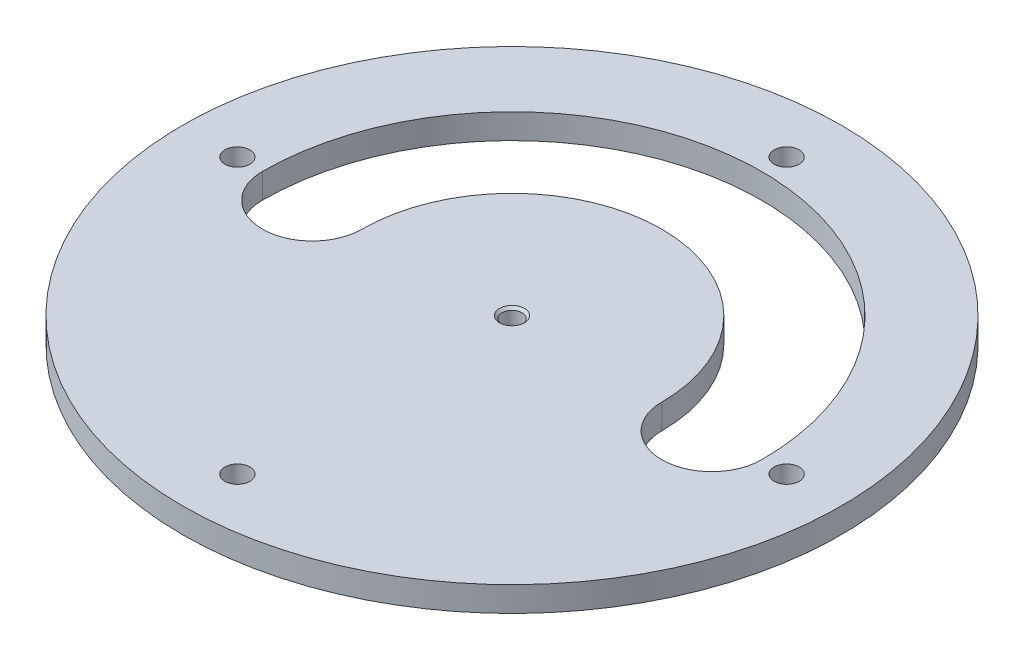
ISO-10303-21;
HEADER;
FILE_DESCRIPTION(('STEP AP214'),'2;1');
FILE_NAME('part.step','',(''),(''),'','','');
FILE_SCHEMA(('AUTOMOTIVE_DESIGN { 1 0 10303 214 1 1 1 1 }'));
ENDSEC;
DATA;
#1=APPLICATION_CONTEXT('core data for automotive mechanical design processes');
#2=APPLICATION_PROTOCOL_DEFINITION('international standard','automotive_design',2000,#1);
#3=PRODUCT_CONTEXT('',#1,'mechanical');
#4=PRODUCT('Part','Part','',(#3));
#5=PRODUCT_RELATED_PRODUCT_CATEGORY('part','',(#4));
#6=PRODUCT_DEFINITION_FORMATION('','',#4);
#7=PRODUCT_DEFINITION_CONTEXT('part definition',#1,'design');
#8=PRODUCT_DEFINITION('design','',#6,#7);
#9=PRODUCT_DEFINITION_SHAPE('','',#8);
#10=(LENGTH_UNIT() NAMED_UNIT(*) SI_UNIT(.MILLI.,.METRE.));
#11=(NAMED_UNIT(*) PLANE_ANGLE_UNIT() SI_UNIT($,.RADIAN.));
#12=(NAMED_UNIT(*) SI_UNIT($,.STERADIAN.) SOLID_ANGLE_UNIT());
#13=UNCERTAINTY_MEASURE_WITH_UNIT(LENGTH_MEASURE(1.E-05),#10,'distance_accuracy_value','');
#14=(GEOMETRIC_REPRESENTATION_CONTEXT(3) GLOBAL_UNCERTAINTY_ASSIGNED_CONTEXT((#13)) GLOBAL_UNIT_ASSIGNED_CONTEXT((#10,
#11,#12)) REPRESENTATION_CONTEXT('',''));
#15=CARTESIAN_POINT('',(0.,0.,0.));
#16=DIRECTION('',(0.,0.,1.));
#17=DIRECTION('',(1.,0.,0.));
#18=AXIS2_PLACEMENT_3D('',#15,#16,#17);
#19=CARTESIAN_POINT('',(0.,2.5,0.));
#20=DIRECTION('',(0.,1.,0.));
#21=DIRECTION('',(0.,0.,1.));
#22=AXIS2_PLACEMENT_3D('',#19,#20,#21);
#23=PLANE('',#22);
#24=CARTESIAN_POINT('',(0.,2.5,0.));
#25=DIRECTION('',(0.,1.,0.));
#26=DIRECTION('',(0.,0.,1.));
#27=AXIS2_PLACEMENT_3D('',#24,#25,#26);
#28=CIRCLE('',#27,1.25000000000003);
#29=CARTESIAN_POINT('',(0.,2.5,1.25000000000003));
#30=VERTEX_POINT('',#29);
#31=EDGE_CURVE('E12',#30,#30,#28,.F.);
#32=ORIENTED_EDGE('',*,*,#31,.T.);
#33=EDGE_LOOP('',(#32));
#34=FACE_BOUND('',#33,.T.);
#35=CARTESIAN_POINT('',(0.,2.5,27.5));
#36=DIRECTION('',(0.,1.,0.));
#37=DIRECTION('',(0.,0.,1.));
#38=AXIS2_PLACEMENT_3D('',#35,#36,#37);
#39=CIRCLE('',#38,1.25000000000019);
#40=CARTESIAN_POINT('',(0.,2.5,28.7500000000002));
#41=VERTEX_POINT('',#40);
#42=EDGE_CURVE('E143',#41,#41,#39,.T.);
#43=ORIENTED_EDGE('',*,*,#42,.F.);
#44=EDGE_LOOP('',(#43));
#45=FACE_BOUND('',#44,.T.);
#46=CARTESIAN_POINT('',(0.,2.5,-27.5));
#47=DIRECTION('',(0.,1.,0.));
#48=DIRECTION('',(0.,0.,1.));
#49=AXIS2_PLACEMENT_3D('',#46,#47,#48);
#50=CIRCLE('',#49,1.25);
#51=CARTESIAN_POINT('',(0.,2.5,-26.25));
#52=VERTEX_POINT('',#51);
#53=EDGE_CURVE('E155',#52,#52,#50,.T.);
#54=ORIENTED_EDGE('',*,*,#53,.F.);
#55=EDGE_LOOP('',(#54));
#56=FACE_BOUND('',#55,.T.);
#57=CARTESIAN_POINT('',(0.,2.5,0.));
#58=DIRECTION('',(0.,1.,0.));
#59=DIRECTION('',(0.,0.,1.));
#60=AXIS2_PLACEMENT_3D('',#57,#58,#59);
#61=CIRCLE('',#60,33.);
#62=CARTESIAN_POINT('',(0.,2.5,33.));
#63=VERTEX_POINT('',#62);
#64=EDGE_CURVE('E167',#63,#63,#61,.T.);
#65=ORIENTED_EDGE('',*,*,#64,.T.);
#66=EDGE_LOOP('',(#65));
#67=FACE_BOUND('',#66,.T.);
#68=CARTESIAN_POINT('',(-27.5,2.5,0.));
#69=DIRECTION('',(0.,1.,0.));
#70=DIRECTION('',(0.,0.,1.));
#71=AXIS2_PLACEMENT_3D('',#68,#69,#70);
#72=CIRCLE('',#71,1.25000000000028);
#73=CARTESIAN_POINT('',(-27.5,2.5,1.25000000000029));
#74=VERTEX_POINT('',#73);
#75=EDGE_CURVE('E161',#74,#74,#72,.T.);
#76=ORIENTED_EDGE('',*,*,#75,.F.);
#77=EDGE_LOOP('',(#76));
#78=FACE_BOUND('',#77,.T.);
#79=CARTESIAN_POINT('',(27.5,2.5,0.));
#80=DIRECTION('',(0.,1.,0.));
#81=DIRECTION('',(0.,0.,1.));
#82=AXIS2_PLACEMENT_3D('',#79,#80,#81);
#83=CIRCLE('',#82,1.25000000000009);
#84=CARTESIAN_POINT('',(27.5,2.5,1.25000000000009));
#85=VERTEX_POINT('',#84);
#86=EDGE_CURVE('E149',#85,#85,#83,.T.);
#87=ORIENTED_EDGE('',*,*,#86,.F.);
#88=EDGE_LOOP('',(#87));
#89=FACE_BOUND('',#88,.T.);
#90=CARTESIAN_POINT('',(0.,2.5,0.));
#91=DIRECTION('',(0.,1.,0.));
#92=DIRECTION('',(0.,0.,1.));
#93=AXIS2_PLACEMENT_3D('',#90,#91,#92);
#94=CIRCLE('',#93,25.);
#95=CARTESIAN_POINT('',(25.,2.5,0.));
#96=VERTEX_POINT('',#95);
#97=CARTESIAN_POINT('',(-25.,2.5,0.));
#98=VERTEX_POINT('',#97);
#99=EDGE_CURVE('E119',#96,#98,#94,.T.);
#100=ORIENTED_EDGE('',*,*,#99,.F.);
#101=CARTESIAN_POINT('',(20.,2.5,0.));
#102=DIRECTION('',(0.,1.,0.));
#103=DIRECTION('',(0.,0.,1.));
#104=AXIS2_PLACEMENT_3D('',#101,#102,#103);
#105=CIRCLE('',#104,5.);
#106=CARTESIAN_POINT('',(15.,2.5,0.));
#107=VERTEX_POINT('',#106);
#108=EDGE_CURVE('E111',#107,#96,#105,.T.);
#109=ORIENTED_EDGE('',*,*,#108,.F.);
#110=CARTESIAN_POINT('',(0.,2.5,0.));
#111=DIRECTION('',(0.,-1.,0.));
#112=DIRECTION('',(0.,0.,1.));
#113=AXIS2_PLACEMENT_3D('',#110,#111,#112);
#114=CIRCLE('',#113,15.);
#115=CARTESIAN_POINT('',(-15.,2.5,0.));
#116=VERTEX_POINT('',#115);
#117=EDGE_CURVE('E133',#116,#107,#114,.T.);
#118=ORIENTED_EDGE('',*,*,#117,.F.);
#119=CARTESIAN_POINT('',(-20.,2.5,0.));
#120=DIRECTION('',(0.,1.,0.));
#121=DIRECTION('',(0.,0.,-1.));
#122=AXIS2_PLACEMENT_3D('',#119,#120,#121);
#123=CIRCLE('',#122,5.);
#124=EDGE_CURVE('E131',#98,#116,#123,.T.);
#125=ORIENTED_EDGE('',*,*,#124,.F.);
#126=EDGE_LOOP('',(#100,#109,#118,#125));
#127=FACE_BOUND('',#126,.T.);
#128=ADVANCED_FACE('F70',(#34,#45,#56,#67,#78,#89,#127),#23,.T.);
#129=CARTESIAN_POINT('',(0.,0.,0.));
#130=DIRECTION('',(0.,1.,0.));
#131=DIRECTION('',(0.,0.,1.));
#132=AXIS2_PLACEMENT_3D('',#129,#130,#131);
#133=PLANE('',#132);
#134=CARTESIAN_POINT('',(0.,0.,0.));
#135=DIRECTION('',(0.,1.,0.));
#136=DIRECTION('',(0.,0.,1.));
#137=AXIS2_PLACEMENT_3D('',#134,#135,#136);
#138=CIRCLE('',#137,1.);
#139=CARTESIAN_POINT('',(0.,0.,1.));
#140=VERTEX_POINT('',#139);
#141=EDGE_CURVE('E127',#140,#140,#138,.T.);
#142=ORIENTED_EDGE('',*,*,#141,.T.);
#143=EDGE_LOOP('',(#142));
#144=FACE_BOUND('',#143,.T.);
#145=CARTESIAN_POINT('',(0.,0.,27.5));
#146=DIRECTION('',(0.,1.,0.));
#147=DIRECTION('',(0.,0.,1.));
#148=AXIS2_PLACEMENT_3D('',#145,#146,#147);
#149=CIRCLE('',#148,1.25000000000019);
#150=CARTESIAN_POINT('',(0.,0.,28.7500000000002));
#151=VERTEX_POINT('',#150);
#152=EDGE_CURVE('E142',#151,#151,#149,.T.);
#153=ORIENTED_EDGE('',*,*,#152,.T.);
#154=EDGE_LOOP('',(#153));
#155=FACE_BOUND('',#154,.T.);
#156=CARTESIAN_POINT('',(27.5,0.,0.));
#157=DIRECTION('',(0.,1.,0.));
#158=DIRECTION('',(0.,0.,1.));
#159=AXIS2_PLACEMENT_3D('',#156,#157,#158);
#160=CIRCLE('',#159,1.25000000000009);
#161=CARTESIAN_POINT('',(27.5,0.,1.25000000000009));
#162=VERTEX_POINT('',#161);
#163=EDGE_CURVE('E146',#162,#162,#160,.T.);
#164=ORIENTED_EDGE('',*,*,#163,.T.);
#165=EDGE_LOOP('',(#164));
#166=FACE_BOUND('',#165,.T.);
#167=CARTESIAN_POINT('',(0.,0.,-27.5));
#168=DIRECTION('',(0.,1.,0.));
#169=DIRECTION('',(0.,0.,1.));
#170=AXIS2_PLACEMENT_3D('',#167,#168,#169);
#171=CIRCLE('',#170,1.25);
#172=CARTESIAN_POINT('',(0.,0.,-26.25));
#173=VERTEX_POINT('',#172);
#174=EDGE_CURVE('E152',#173,#173,#171,.T.);
#175=ORIENTED_EDGE('',*,*,#174,.T.);
#176=EDGE_LOOP('',(#175));
#177=FACE_BOUND('',#176,.T.);
#178=CARTESIAN_POINT('',(-27.5,0.,0.));
#179=DIRECTION('',(0.,1.,0.));
#180=DIRECTION('',(0.,0.,1.));
#181=AXIS2_PLACEMENT_3D('',#178,#179,#180);
#182=CIRCLE('',#181,1.25000000000028);
#183=CARTESIAN_POINT('',(-27.5,0.,1.25000000000029));
#184=VERTEX_POINT('',#183);
#185=EDGE_CURVE('E158',#184,#184,#182,.T.);
#186=ORIENTED_EDGE('',*,*,#185,.T.);
#187=EDGE_LOOP('',(#186));
#188=FACE_BOUND('',#187,.T.);
#189=CARTESIAN_POINT('',(0.,0.,0.));
#190=DIRECTION('',(0.,1.,0.));
#191=DIRECTION('',(0.,0.,1.));
#192=AXIS2_PLACEMENT_3D('',#189,#190,#191);
#193=CIRCLE('',#192,33.);
#194=CARTESIAN_POINT('',(0.,0.,33.));
#195=VERTEX_POINT('',#194);
#196=EDGE_CURVE('E164',#195,#195,#193,.T.);
#197=ORIENTED_EDGE('',*,*,#196,.F.);
#198=EDGE_LOOP('',(#197));
#199=FACE_BOUND('',#198,.T.);
#200=CARTESIAN_POINT('',(20.,0.,0.));
#201=DIRECTION('',(0.,1.,0.));
#202=DIRECTION('',(0.,0.,1.));
#203=AXIS2_PLACEMENT_3D('',#200,#201,#202);
#204=CIRCLE('',#203,5.);
#205=CARTESIAN_POINT('',(25.,0.,0.));
#206=VERTEX_POINT('',#205);
#207=CARTESIAN_POINT('',(15.,0.,0.));
#208=VERTEX_POINT('',#207);
#209=EDGE_CURVE('E177',#206,#208,#204,.F.);
#210=ORIENTED_EDGE('',*,*,#209,.F.);
#211=CARTESIAN_POINT('',(0.,0.,0.));
#212=DIRECTION('',(0.,1.,0.));
#213=DIRECTION('',(0.,0.,1.));
#214=AXIS2_PLACEMENT_3D('',#211,#212,#213);
#215=CIRCLE('',#214,25.);
#216=CARTESIAN_POINT('',(-25.,0.,0.));
#217=VERTEX_POINT('',#216);
#218=EDGE_CURVE('E126',#217,#206,#215,.F.);
#219=ORIENTED_EDGE('',*,*,#218,.F.);
#220=CARTESIAN_POINT('',(-20.,0.,0.));
#221=DIRECTION('',(0.,1.,0.));
#222=DIRECTION('',(0.,0.,1.));
#223=AXIS2_PLACEMENT_3D('',#220,#221,#222);
#224=CIRCLE('',#223,5.);
#225=CARTESIAN_POINT('',(-15.,0.,0.));
#226=VERTEX_POINT('',#225);
#227=EDGE_CURVE('E174',#226,#217,#224,.F.);
#228=ORIENTED_EDGE('',*,*,#227,.F.);
#229=CARTESIAN_POINT('',(0.,0.,0.));
#230=DIRECTION('',(0.,1.,0.));
#231=DIRECTION('',(0.,0.,1.));
#232=AXIS2_PLACEMENT_3D('',#229,#230,#231);
#233=CIRCLE('',#232,15.);
#234=EDGE_CURVE('E170',#208,#226,#233,.T.);
#235=ORIENTED_EDGE('',*,*,#234,.F.);
#236=EDGE_LOOP('',(#210,#219,#228,#235));
#237=FACE_BOUND('',#236,.T.);
#238=ADVANCED_FACE('F194',(#144,#155,#166,#177,#188,#199,#237),#133,.F.);
#239=CARTESIAN_POINT('',(0.,2.5,0.));
#240=DIRECTION('',(0.,-1.,0.));
#241=DIRECTION('',(0.,0.,-1.));
#242=AXIS2_PLACEMENT_3D('',#239,#240,#241);
#243=CYLINDRICAL_SURFACE('',#242,33.);
#244=ORIENTED_EDGE('',*,*,#64,.F.);
#245=EDGE_LOOP('',(#244));
#246=FACE_BOUND('',#245,.T.);
#247=ORIENTED_EDGE('',*,*,#196,.T.);
#248=EDGE_LOOP('',(#247));
#249=FACE_BOUND('',#248,.T.);
#250=ADVANCED_FACE('F200',(#246,#249),#243,.T.);
#251=CARTESIAN_POINT('',(-27.5,2.5,0.));
#252=DIRECTION('',(0.,-1.,0.));
#253=DIRECTION('',(0.,0.,-1.));
#254=AXIS2_PLACEMENT_3D('',#251,#252,#253);
#255=CYLINDRICAL_SURFACE('',#254,1.25000000000028);
#256=ORIENTED_EDGE('',*,*,#75,.T.);
#257=EDGE_LOOP('',(#256));
#258=FACE_BOUND('',#257,.T.);
#259=ORIENTED_EDGE('',*,*,#185,.F.);
#260=EDGE_LOOP('',(#259));
#261=FACE_BOUND('',#260,.T.);
#262=ADVANCED_FACE('F205',(#258,#261),#255,.F.);
#263=CARTESIAN_POINT('',(0.,2.5,-27.5));
#264=DIRECTION('',(0.,-1.,0.));
#265=DIRECTION('',(0.,0.,-1.));
#266=AXIS2_PLACEMENT_3D('',#263,#264,#265);
#267=CYLINDRICAL_SURFACE('',#266,1.25);
#268=ORIENTED_EDGE('',*,*,#53,.T.);
#269=EDGE_LOOP('',(#268));
#270=FACE_BOUND('',#269,.T.);
#271=ORIENTED_EDGE('',*,*,#174,.F.);
#272=EDGE_LOOP('',(#271));
#273=FACE_BOUND('',#272,.T.);
#274=ADVANCED_FACE('F212',(#270,#273),#267,.F.);
#275=CARTESIAN_POINT('',(27.5,2.5,0.));
#276=DIRECTION('',(0.,-1.,0.));
#277=DIRECTION('',(0.,0.,-1.));
#278=AXIS2_PLACEMENT_3D('',#275,#276,#277);
#279=CYLINDRICAL_SURFACE('',#278,1.25000000000009);
#280=ORIENTED_EDGE('',*,*,#86,.T.);
#281=EDGE_LOOP('',(#280));
#282=FACE_BOUND('',#281,.T.);
#283=ORIENTED_EDGE('',*,*,#163,.F.);
#284=EDGE_LOOP('',(#283));
#285=FACE_BOUND('',#284,.T.);
#286=ADVANCED_FACE('F236',(#282,#285),#279,.F.);
#287=CARTESIAN_POINT('',(0.,2.5,27.5));
#288=DIRECTION('',(0.,-1.,0.));
#289=DIRECTION('',(0.,0.,-1.));
#290=AXIS2_PLACEMENT_3D('',#287,#288,#289);
#291=CYLINDRICAL_SURFACE('',#290,1.25000000000019);
#292=ORIENTED_EDGE('',*,*,#42,.T.);
#293=EDGE_LOOP('',(#292));
#294=FACE_BOUND('',#293,.T.);
#295=ORIENTED_EDGE('',*,*,#152,.F.);
#296=EDGE_LOOP('',(#295));
#297=FACE_BOUND('',#296,.T.);
#298=ADVANCED_FACE('F233',(#294,#297),#291,.F.);
#299=CARTESIAN_POINT('',(0.,2.5,0.));
#300=DIRECTION('',(0.,-1.,0.));
#301=DIRECTION('',(0.,0.,-1.));
#302=AXIS2_PLACEMENT_3D('',#299,#300,#301);
#303=CYLINDRICAL_SURFACE('',#302,1.);
#304=CARTESIAN_POINT('',(0.,2.24999999999998,0.));
#305=DIRECTION('',(0.,1.,0.));
#306=DIRECTION('',(0.,0.,1.));
#307=AXIS2_PLACEMENT_3D('',#304,#305,#306);
#308=CIRCLE('',#307,1.);
#309=CARTESIAN_POINT('',(0.,2.24999999999998,1.));
#310=VERTEX_POINT('',#309);
#311=EDGE_CURVE('E79',#310,#310,#308,.T.);
#312=ORIENTED_EDGE('',*,*,#311,.T.);
#313=EDGE_LOOP('',(#312));
#314=FACE_BOUND('',#313,.T.);
#315=ORIENTED_EDGE('',*,*,#141,.F.);
#316=EDGE_LOOP('',(#315));
#317=FACE_BOUND('',#316,.T.);
#318=ADVANCED_FACE('F181',(#314,#317),#303,.F.);
#319=CARTESIAN_POINT('',(20.,2.5,0.));
#320=DIRECTION('',(0.,-1.,0.));
#321=DIRECTION('',(0.,0.,-1.));
#322=AXIS2_PLACEMENT_3D('',#319,#320,#321);
#323=CYLINDRICAL_SURFACE('',#322,5.);
#324=ORIENTED_EDGE('',*,*,#209,.T.);
#325=DIRECTION('',(0.,-1.,0.));
#326=VECTOR('',#325,1.);
#327=CARTESIAN_POINT('',(15.,2.5,0.));
#328=LINE('',#327,#326);
#329=EDGE_CURVE('E91',#107,#208,#328,.T.);
#330=ORIENTED_EDGE('',*,*,#329,.F.);
#331=ORIENTED_EDGE('',*,*,#108,.T.);
#332=DIRECTION('',(0.,-1.,0.));
#333=VECTOR('',#332,1.);
#334=CARTESIAN_POINT('',(25.,2.5,0.));
#335=LINE('',#334,#333);
#336=EDGE_CURVE('E114',#96,#206,#335,.T.);
#337=ORIENTED_EDGE('',*,*,#336,.T.);
#338=EDGE_LOOP('',(#324,#330,#331,#337));
#339=FACE_BOUND('',#338,.T.);
#340=ADVANCED_FACE('F113',(#339),#323,.F.);
#341=CARTESIAN_POINT('',(0.,2.5,0.));
#342=DIRECTION('',(0.,-1.,0.));
#343=DIRECTION('',(0.,0.,-1.));
#344=AXIS2_PLACEMENT_3D('',#341,#342,#343);
#345=CYLINDRICAL_SURFACE('',#344,25.);
#346=ORIENTED_EDGE('',*,*,#218,.T.);
#347=ORIENTED_EDGE('',*,*,#336,.F.);
#348=ORIENTED_EDGE('',*,*,#99,.T.);
#349=DIRECTION('',(0.,-1.,0.));
#350=VECTOR('',#349,1.);
#351=CARTESIAN_POINT('',(-25.,2.5,0.));
#352=LINE('',#351,#350);
#353=EDGE_CURVE('E128',#98,#217,#352,.T.);
#354=ORIENTED_EDGE('',*,*,#353,.T.);
#355=EDGE_LOOP('',(#346,#347,#348,#354));
#356=FACE_BOUND('',#355,.T.);
#357=ADVANCED_FACE('F122',(#356),#345,.F.);
#358=CARTESIAN_POINT('',(-20.,2.5,0.));
#359=DIRECTION('',(0.,-1.,0.));
#360=DIRECTION('',(0.,0.,-1.));
#361=AXIS2_PLACEMENT_3D('',#358,#359,#360);
#362=CYLINDRICAL_SURFACE('',#361,5.);
#363=ORIENTED_EDGE('',*,*,#227,.T.);
#364=ORIENTED_EDGE('',*,*,#353,.F.);
#365=ORIENTED_EDGE('',*,*,#124,.T.);
#366=DIRECTION('',(0.,-1.,0.));
#367=VECTOR('',#366,1.);
#368=CARTESIAN_POINT('',(-15.,2.5,0.));
#369=LINE('',#368,#367);
#370=EDGE_CURVE('E86',#116,#226,#369,.T.);
#371=ORIENTED_EDGE('',*,*,#370,.T.);
#372=EDGE_LOOP('',(#363,#364,#365,#371));
#373=FACE_BOUND('',#372,.T.);
#374=ADVANCED_FACE('F190',(#373),#362,.F.);
#375=CARTESIAN_POINT('',(0.,2.5,0.));
#376=DIRECTION('',(0.,-1.,0.));
#377=DIRECTION('',(0.,0.,-1.));
#378=AXIS2_PLACEMENT_3D('',#375,#376,#377);
#379=CYLINDRICAL_SURFACE('',#378,15.);
#380=ORIENTED_EDGE('',*,*,#234,.T.);
#381=ORIENTED_EDGE('',*,*,#370,.F.);
#382=ORIENTED_EDGE('',*,*,#117,.T.);
#383=ORIENTED_EDGE('',*,*,#329,.T.);
#384=EDGE_LOOP('',(#380,#381,#382,#383));
#385=FACE_BOUND('',#384,.T.);
#386=ADVANCED_FACE('F185',(#385),#379,.T.);
#387=CARTESIAN_POINT('',(0.,2.24999999999998,0.));
#388=DIRECTION('',(0.,1.,0.));
#389=DIRECTION('',(0.,0.,1.));
#390=AXIS2_PLACEMENT_3D('',#387,#388,#389);
#391=CONICAL_SURFACE('',#390,1.,0.785398163397469);
#392=ORIENTED_EDGE('',*,*,#31,.F.);
#393=EDGE_LOOP('',(#392));
#394=FACE_BOUND('',#393,.T.);
#395=ORIENTED_EDGE('',*,*,#311,.F.);
#396=EDGE_LOOP('',(#395));
#397=FACE_BOUND('',#396,.T.);
#398=ADVANCED_FACE('F73',(#394,#397),#391,.F.);
#399=CLOSED_SHELL('',(#128,#238,#250,#262,#274,#286,#298,#318,#340,#357,#374,#386,#398));
#400=MANIFOLD_SOLID_BREP('B2',#399);
#401=ADVANCED_BREP_SHAPE_REPRESENTATION('',(#18,#400),#14);
#402=SHAPE_DEFINITION_REPRESENTATION(#9,#401);
ENDSEC;
END-ISO-10303-21;
